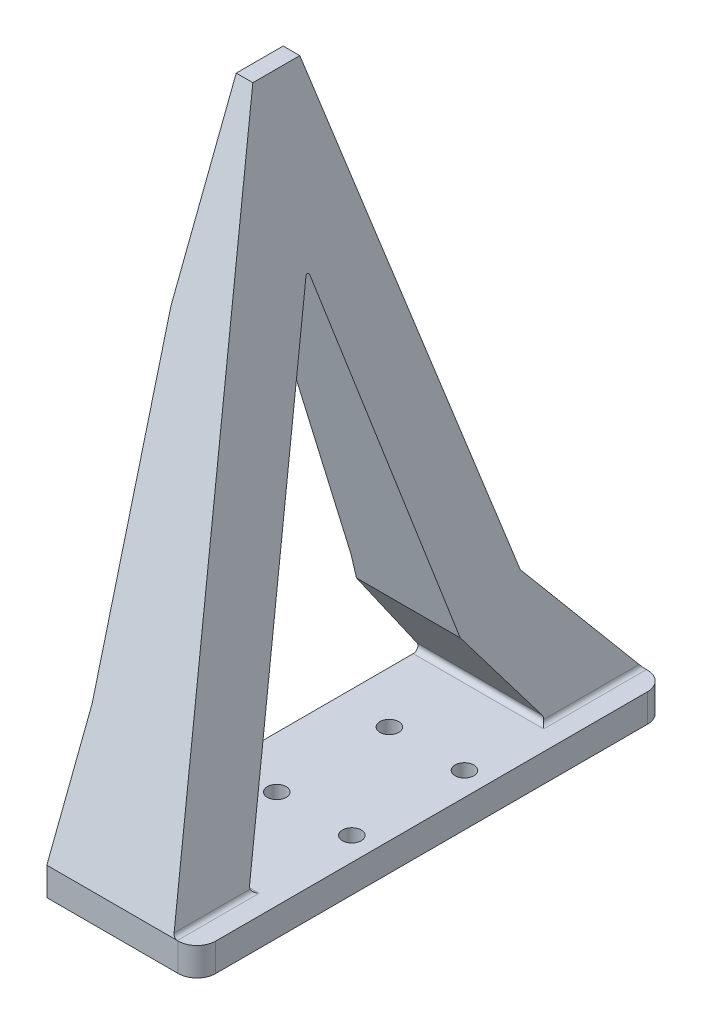
ISO-10303-21;
HEADER;
FILE_DESCRIPTION(('STEP AP214'),'2;1');
FILE_NAME('part.step','',(''),(''),'','','');
FILE_SCHEMA(('AUTOMOTIVE_DESIGN { 1 0 10303 214 1 1 1 1 }'));
ENDSEC;
DATA;
#1=APPLICATION_CONTEXT('core data for automotive mechanical design processes');
#2=APPLICATION_PROTOCOL_DEFINITION('international standard','automotive_design',2000,#1);
#3=PRODUCT_CONTEXT('',#1,'mechanical');
#4=PRODUCT('Part','Part','',(#3));
#5=PRODUCT_RELATED_PRODUCT_CATEGORY('part','',(#4));
#6=PRODUCT_DEFINITION_FORMATION('','',#4);
#7=PRODUCT_DEFINITION_CONTEXT('part definition',#1,'design');
#8=PRODUCT_DEFINITION('design','',#6,#7);
#9=PRODUCT_DEFINITION_SHAPE('','',#8);
#10=(LENGTH_UNIT() NAMED_UNIT(*) SI_UNIT(.MILLI.,.METRE.));
#11=(NAMED_UNIT(*) PLANE_ANGLE_UNIT() SI_UNIT($,.RADIAN.));
#12=(NAMED_UNIT(*) SI_UNIT($,.STERADIAN.) SOLID_ANGLE_UNIT());
#13=UNCERTAINTY_MEASURE_WITH_UNIT(LENGTH_MEASURE(1.E-05),#10,'distance_accuracy_value','');
#14=(GEOMETRIC_REPRESENTATION_CONTEXT(3) GLOBAL_UNCERTAINTY_ASSIGNED_CONTEXT((#13)) GLOBAL_UNIT_ASSIGNED_CONTEXT((#10,
#11,#12)) REPRESENTATION_CONTEXT('',''));
#15=CARTESIAN_POINT('',(0.,0.,0.));
#16=DIRECTION('',(0.,0.,1.));
#17=DIRECTION('',(1.,0.,0.));
#18=AXIS2_PLACEMENT_3D('',#15,#16,#17);
#19=CARTESIAN_POINT('',(7.25,3.,23.));
#20=DIRECTION('',(0.,1.,0.));
#21=DIRECTION('',(0.,0.,1.));
#22=AXIS2_PLACEMENT_3D('',#19,#20,#21);
#23=PLANE('',#22);
#24=DIRECTION('',(0.,0.,-1.));
#25=VECTOR('',#24,1.);
#26=CARTESIAN_POINT('',(-6.75,3.,23.));
#27=LINE('',#26,#25);
#28=CARTESIAN_POINT('',(-6.75,3.,16.2707965265877));
#29=VERTEX_POINT('',#28);
#30=CARTESIAN_POINT('',(-6.75000000000001,3.,-14.0396722192133));
#31=VERTEX_POINT('',#30);
#32=EDGE_CURVE('E432',#29,#31,#27,.T.);
#33=ORIENTED_EDGE('',*,*,#32,.F.);
#34=DIRECTION('',(1.,0.,0.));
#35=VECTOR('',#34,1.);
#36=CARTESIAN_POINT('',(7.25,3.,16.2707965265877));
#37=LINE('',#36,#35);
#38=CARTESIAN_POINT('',(7.14980374572617,3.,16.2707965265877));
#39=VERTEX_POINT('',#38);
#40=EDGE_CURVE('E284',#29,#39,#37,.T.);
#41=ORIENTED_EDGE('',*,*,#40,.T.);
#42=DIRECTION('',(0.,0.,-1.));
#43=VECTOR('',#42,1.);
#44=CARTESIAN_POINT('',(7.14980374572618,3.,23.));
#45=LINE('',#44,#43);
#46=CARTESIAN_POINT('',(7.14980374572618,3.,25.));
#47=VERTEX_POINT('',#46);
#48=EDGE_CURVE('E280',#39,#47,#45,.F.);
#49=ORIENTED_EDGE('',*,*,#48,.T.);
#50=DIRECTION('',(1.,0.,0.));
#51=VECTOR('',#50,1.);
#52=CARTESIAN_POINT('',(-9.25,3.,25.));
#53=LINE('',#52,#51);
#54=CARTESIAN_POINT('',(7.25,3.,25.));
#55=VERTEX_POINT('',#54);
#56=EDGE_CURVE('E244',#47,#55,#53,.T.);
#57=ORIENTED_EDGE('',*,*,#56,.T.);
#58=CARTESIAN_POINT('',(7.25,3.,23.));
#59=DIRECTION('',(0.,1.,0.));
#60=DIRECTION('',(0.,0.,1.));
#61=AXIS2_PLACEMENT_3D('',#58,#59,#60);
#62=CIRCLE('',#61,2.);
#63=CARTESIAN_POINT('',(9.25,3.,23.));
#64=VERTEX_POINT('',#63);
#65=EDGE_CURVE('E342',#55,#64,#62,.T.);
#66=ORIENTED_EDGE('',*,*,#65,.T.);
#67=DIRECTION('',(0.,0.,-1.));
#68=VECTOR('',#67,1.);
#69=CARTESIAN_POINT('',(9.24999999999999,3.,-23.));
#70=LINE('',#69,#68);
#71=CARTESIAN_POINT('',(9.24999999999999,3.,-23.));
#72=VERTEX_POINT('',#71);
#73=EDGE_CURVE('E340',#64,#72,#70,.T.);
#74=ORIENTED_EDGE('',*,*,#73,.T.);
#75=CARTESIAN_POINT('',(7.25,3.,-23.));
#76=DIRECTION('',(0.,1.,0.));
#77=DIRECTION('',(0.,0.,-1.));
#78=AXIS2_PLACEMENT_3D('',#75,#76,#77);
#79=CIRCLE('',#78,2.);
#80=CARTESIAN_POINT('',(7.25,3.,-25.));
#81=VERTEX_POINT('',#80);
#82=EDGE_CURVE('E338',#72,#81,#79,.T.);
#83=ORIENTED_EDGE('',*,*,#82,.T.);
#84=DIRECTION('',(-1.,0.,0.));
#85=VECTOR('',#84,1.);
#86=CARTESIAN_POINT('',(-9.25000000000001,3.,-25.));
#87=LINE('',#86,#85);
#88=CARTESIAN_POINT('',(7.14980374572616,3.,-25.));
#89=VERTEX_POINT('',#88);
#90=EDGE_CURVE('E233',#81,#89,#87,.T.);
#91=ORIENTED_EDGE('',*,*,#90,.T.);
#92=DIRECTION('',(0.,0.,-1.));
#93=VECTOR('',#92,1.);
#94=CARTESIAN_POINT('',(7.14980374572618,3.,23.));
#95=LINE('',#94,#93);
#96=CARTESIAN_POINT('',(7.14980374572617,3.,-14.0396722192133));
#97=VERTEX_POINT('',#96);
#98=EDGE_CURVE('E274',#89,#97,#95,.F.);
#99=ORIENTED_EDGE('',*,*,#98,.T.);
#100=DIRECTION('',(1.,0.,0.));
#101=VECTOR('',#100,1.);
#102=CARTESIAN_POINT('',(7.25,3.,-14.0396722192133));
#103=LINE('',#102,#101);
#104=EDGE_CURVE('E277',#97,#31,#103,.F.);
#105=ORIENTED_EDGE('',*,*,#104,.T.);
#106=EDGE_LOOP('',(#33,#41,#49,#57,#66,#74,#83,#91,#99,#105));
#107=FACE_BOUND('',#106,.T.);
#108=CARTESIAN_POINT('',(6.75,3.,-6.));
#109=DIRECTION('',(0.,1.,0.));
#110=DIRECTION('',(0.,0.,1.));
#111=AXIS2_PLACEMENT_3D('',#108,#109,#110);
#112=CIRCLE('',#111,1.);
#113=CARTESIAN_POINT('',(6.75,3.,-5.));
#114=VERTEX_POINT('',#113);
#115=EDGE_CURVE('E367',#114,#114,#112,.T.);
#116=ORIENTED_EDGE('',*,*,#115,.F.);
#117=EDGE_LOOP('',(#116));
#118=FACE_BOUND('',#117,.T.);
#119=CARTESIAN_POINT('',(6.75,3.,6.));
#120=DIRECTION('',(0.,1.,0.));
#121=DIRECTION('',(0.,0.,1.));
#122=AXIS2_PLACEMENT_3D('',#119,#120,#121);
#123=CIRCLE('',#122,1.);
#124=CARTESIAN_POINT('',(6.75,3.,7.));
#125=VERTEX_POINT('',#124);
#126=EDGE_CURVE('E358',#125,#125,#123,.T.);
#127=ORIENTED_EDGE('',*,*,#126,.F.);
#128=EDGE_LOOP('',(#127));
#129=FACE_BOUND('',#128,.T.);
#130=CARTESIAN_POINT('',(-1.25,3.,6.));
#131=DIRECTION('',(0.,1.,0.));
#132=DIRECTION('',(0.,0.,1.));
#133=AXIS2_PLACEMENT_3D('',#130,#131,#132);
#134=CIRCLE('',#133,1.);
#135=CARTESIAN_POINT('',(-1.25,3.,7.));
#136=VERTEX_POINT('',#135);
#137=EDGE_CURVE('E350',#136,#136,#134,.T.);
#138=ORIENTED_EDGE('',*,*,#137,.F.);
#139=EDGE_LOOP('',(#138));
#140=FACE_BOUND('',#139,.T.);
#141=CARTESIAN_POINT('',(-1.25,3.,-6.));
#142=DIRECTION('',(0.,1.,0.));
#143=DIRECTION('',(0.,0.,1.));
#144=AXIS2_PLACEMENT_3D('',#141,#142,#143);
#145=CIRCLE('',#144,1.);
#146=CARTESIAN_POINT('',(-1.25,3.,-5.));
#147=VERTEX_POINT('',#146);
#148=EDGE_CURVE('E354',#147,#147,#145,.T.);
#149=ORIENTED_EDGE('',*,*,#148,.F.);
#150=EDGE_LOOP('',(#149));
#151=FACE_BOUND('',#150,.T.);
#152=ADVANCED_FACE('F39',(#107,#118,#129,#140,#151),#23,.T.);
#153=CARTESIAN_POINT('',(7.25,0.,23.));
#154=DIRECTION('',(0.,1.,0.));
#155=DIRECTION('',(0.,0.,1.));
#156=AXIS2_PLACEMENT_3D('',#153,#154,#155);
#157=PLANE('',#156);
#158=DIRECTION('',(1.,0.,0.));
#159=VECTOR('',#158,1.);
#160=CARTESIAN_POINT('',(-9.25,0.,25.));
#161=LINE('',#160,#159);
#162=CARTESIAN_POINT('',(-6.75,0.,25.));
#163=VERTEX_POINT('',#162);
#164=CARTESIAN_POINT('',(7.25,0.,25.));
#165=VERTEX_POINT('',#164);
#166=EDGE_CURVE('E210',#163,#165,#161,.T.);
#167=ORIENTED_EDGE('',*,*,#166,.F.);
#168=DIRECTION('',(0.,0.,-1.));
#169=VECTOR('',#168,1.);
#170=CARTESIAN_POINT('',(-6.75,0.,25.));
#171=LINE('',#170,#169);
#172=CARTESIAN_POINT('',(-6.75000000000001,0.,-25.));
#173=VERTEX_POINT('',#172);
#174=EDGE_CURVE('E190',#163,#173,#171,.T.);
#175=ORIENTED_EDGE('',*,*,#174,.T.);
#176=DIRECTION('',(-1.,0.,0.));
#177=VECTOR('',#176,1.);
#178=CARTESIAN_POINT('',(-9.25000000000001,0.,-25.));
#179=LINE('',#178,#177);
#180=CARTESIAN_POINT('',(7.25,0.,-25.));
#181=VERTEX_POINT('',#180);
#182=EDGE_CURVE('E241',#181,#173,#179,.T.);
#183=ORIENTED_EDGE('',*,*,#182,.F.);
#184=CARTESIAN_POINT('',(7.25,0.,-23.));
#185=DIRECTION('',(0.,1.,0.));
#186=DIRECTION('',(0.,0.,-1.));
#187=AXIS2_PLACEMENT_3D('',#184,#185,#186);
#188=CIRCLE('',#187,2.);
#189=CARTESIAN_POINT('',(9.24999999999999,0.,-23.));
#190=VERTEX_POINT('',#189);
#191=EDGE_CURVE('E238',#190,#181,#188,.T.);
#192=ORIENTED_EDGE('',*,*,#191,.F.);
#193=DIRECTION('',(0.,0.,-1.));
#194=VECTOR('',#193,1.);
#195=CARTESIAN_POINT('',(9.24999999999999,0.,-23.));
#196=LINE('',#195,#194);
#197=CARTESIAN_POINT('',(9.25,0.,23.));
#198=VERTEX_POINT('',#197);
#199=EDGE_CURVE('E227',#198,#190,#196,.T.);
#200=ORIENTED_EDGE('',*,*,#199,.F.);
#201=CARTESIAN_POINT('',(7.25,0.,23.));
#202=DIRECTION('',(0.,1.,0.));
#203=DIRECTION('',(0.,0.,1.));
#204=AXIS2_PLACEMENT_3D('',#201,#202,#203);
#205=CIRCLE('',#204,2.);
#206=EDGE_CURVE('E220',#165,#198,#205,.T.);
#207=ORIENTED_EDGE('',*,*,#206,.F.);
#208=EDGE_LOOP('',(#167,#175,#183,#192,#200,#207));
#209=FACE_BOUND('',#208,.T.);
#210=CARTESIAN_POINT('',(-1.25,0.,6.));
#211=DIRECTION('',(0.,1.,0.));
#212=DIRECTION('',(0.,0.,1.));
#213=AXIS2_PLACEMENT_3D('',#210,#211,#212);
#214=CIRCLE('',#213,1.);
#215=CARTESIAN_POINT('',(-1.25,0.,7.));
#216=VERTEX_POINT('',#215);
#217=EDGE_CURVE('E223',#216,#216,#214,.T.);
#218=ORIENTED_EDGE('',*,*,#217,.T.);
#219=EDGE_LOOP('',(#218));
#220=FACE_BOUND('',#219,.T.);
#221=CARTESIAN_POINT('',(-1.25,0.,-6.));
#222=DIRECTION('',(0.,1.,0.));
#223=DIRECTION('',(0.,0.,1.));
#224=AXIS2_PLACEMENT_3D('',#221,#222,#223);
#225=CIRCLE('',#224,1.);
#226=CARTESIAN_POINT('',(-1.25,0.,-5.));
#227=VERTEX_POINT('',#226);
#228=EDGE_CURVE('E230',#227,#227,#225,.T.);
#229=ORIENTED_EDGE('',*,*,#228,.T.);
#230=EDGE_LOOP('',(#229));
#231=FACE_BOUND('',#230,.T.);
#232=CARTESIAN_POINT('',(6.75,0.,6.));
#233=DIRECTION('',(0.,1.,0.));
#234=DIRECTION('',(0.,0.,1.));
#235=AXIS2_PLACEMENT_3D('',#232,#233,#234);
#236=CIRCLE('',#235,1.);
#237=CARTESIAN_POINT('',(6.75,0.,7.));
#238=VERTEX_POINT('',#237);
#239=EDGE_CURVE('E363',#238,#238,#236,.T.);
#240=ORIENTED_EDGE('',*,*,#239,.T.);
#241=EDGE_LOOP('',(#240));
#242=FACE_BOUND('',#241,.T.);
#243=CARTESIAN_POINT('',(6.75,0.,-6.));
#244=DIRECTION('',(0.,1.,0.));
#245=DIRECTION('',(0.,0.,1.));
#246=AXIS2_PLACEMENT_3D('',#243,#244,#245);
#247=CIRCLE('',#246,1.);
#248=CARTESIAN_POINT('',(6.75,0.,-5.));
#249=VERTEX_POINT('',#248);
#250=EDGE_CURVE('E362',#249,#249,#247,.T.);
#251=ORIENTED_EDGE('',*,*,#250,.T.);
#252=EDGE_LOOP('',(#251));
#253=FACE_BOUND('',#252,.T.);
#254=ADVANCED_FACE('F217',(#209,#220,#231,#242,#253),#157,.F.);
#255=CARTESIAN_POINT('',(-9.25,3.,25.));
#256=DIRECTION('',(0.,0.,-1.));
#257=DIRECTION('',(-1.,0.,0.));
#258=AXIS2_PLACEMENT_3D('',#255,#256,#257);
#259=PLANE('',#258);
#260=DIRECTION('',(1.,0.,0.));
#261=VECTOR('',#260,1.);
#262=CARTESIAN_POINT('',(-9.25000000000001,3.,25.));
#263=LINE('',#262,#261);
#264=CARTESIAN_POINT('',(-6.75,3.,25.));
#265=VERTEX_POINT('',#264);
#266=EDGE_CURVE('E213',#265,#47,#263,.T.);
#267=ORIENTED_EDGE('',*,*,#266,.F.);
#268=DIRECTION('',(0.,-1.,0.));
#269=VECTOR('',#268,1.);
#270=CARTESIAN_POINT('',(-6.75,15.5,25.));
#271=LINE('',#270,#269);
#272=EDGE_CURVE('E194',#265,#163,#271,.T.);
#273=ORIENTED_EDGE('',*,*,#272,.T.);
#274=ORIENTED_EDGE('',*,*,#166,.T.);
#275=DIRECTION('',(0.,-1.,0.));
#276=VECTOR('',#275,1.);
#277=CARTESIAN_POINT('',(7.25,3.,25.));
#278=LINE('',#277,#276);
#279=EDGE_CURVE('E257',#55,#165,#278,.T.);
#280=ORIENTED_EDGE('',*,*,#279,.F.);
#281=ORIENTED_EDGE('',*,*,#56,.F.);
#282=EDGE_LOOP('',(#267,#273,#274,#280,#281));
#283=FACE_BOUND('',#282,.T.);
#284=ADVANCED_FACE('F208',(#283),#259,.F.);
#285=CARTESIAN_POINT('',(7.25,3.,23.));
#286=DIRECTION('',(0.,-1.,0.));
#287=DIRECTION('',(0.,0.,-1.));
#288=AXIS2_PLACEMENT_3D('',#285,#286,#287);
#289=CYLINDRICAL_SURFACE('',#288,2.);
#290=ORIENTED_EDGE('',*,*,#206,.T.);
#291=DIRECTION('',(0.,-1.,0.));
#292=VECTOR('',#291,1.);
#293=CARTESIAN_POINT('',(9.25,3.,23.));
#294=LINE('',#293,#292);
#295=EDGE_CURVE('E253',#64,#198,#294,.T.);
#296=ORIENTED_EDGE('',*,*,#295,.F.);
#297=ORIENTED_EDGE('',*,*,#65,.F.);
#298=ORIENTED_EDGE('',*,*,#279,.T.);
#299=EDGE_LOOP('',(#290,#296,#297,#298));
#300=FACE_BOUND('',#299,.T.);
#301=ADVANCED_FACE('F569',(#300),#289,.T.);
#302=CARTESIAN_POINT('',(9.24999999999999,3.,-23.));
#303=DIRECTION('',(-1.,0.,0.));
#304=DIRECTION('',(0.,0.,1.));
#305=AXIS2_PLACEMENT_3D('',#302,#303,#304);
#306=PLANE('',#305);
#307=ORIENTED_EDGE('',*,*,#199,.T.);
#308=DIRECTION('',(0.,-1.,0.));
#309=VECTOR('',#308,1.);
#310=CARTESIAN_POINT('',(9.24999999999999,3.,-23.));
#311=LINE('',#310,#309);
#312=EDGE_CURVE('E249',#72,#190,#311,.T.);
#313=ORIENTED_EDGE('',*,*,#312,.F.);
#314=ORIENTED_EDGE('',*,*,#73,.F.);
#315=ORIENTED_EDGE('',*,*,#295,.T.);
#316=EDGE_LOOP('',(#307,#313,#314,#315));
#317=FACE_BOUND('',#316,.T.);
#318=ADVANCED_FACE('F565',(#317),#306,.F.);
#319=CARTESIAN_POINT('',(7.25,3.,-23.));
#320=DIRECTION('',(0.,-1.,0.));
#321=DIRECTION('',(0.,0.,-1.));
#322=AXIS2_PLACEMENT_3D('',#319,#320,#321);
#323=CYLINDRICAL_SURFACE('',#322,2.);
#324=ORIENTED_EDGE('',*,*,#191,.T.);
#325=DIRECTION('',(0.,-1.,0.));
#326=VECTOR('',#325,1.);
#327=CARTESIAN_POINT('',(7.25,3.,-25.));
#328=LINE('',#327,#326);
#329=EDGE_CURVE('E245',#81,#181,#328,.T.);
#330=ORIENTED_EDGE('',*,*,#329,.F.);
#331=ORIENTED_EDGE('',*,*,#82,.F.);
#332=ORIENTED_EDGE('',*,*,#312,.T.);
#333=EDGE_LOOP('',(#324,#330,#331,#332));
#334=FACE_BOUND('',#333,.T.);
#335=ADVANCED_FACE('F561',(#334),#323,.T.);
#336=CARTESIAN_POINT('',(-9.25000000000001,3.,-25.));
#337=DIRECTION('',(0.,0.,1.));
#338=DIRECTION('',(1.,0.,0.));
#339=AXIS2_PLACEMENT_3D('',#336,#337,#338);
#340=PLANE('',#339);
#341=ORIENTED_EDGE('',*,*,#182,.T.);
#342=DIRECTION('',(0.,-1.,0.));
#343=VECTOR('',#342,1.);
#344=CARTESIAN_POINT('',(-6.75000000000001,15.5,-25.));
#345=LINE('',#344,#343);
#346=CARTESIAN_POINT('',(-6.75000000000001,3.,-25.));
#347=VERTEX_POINT('',#346);
#348=EDGE_CURVE('E197',#347,#173,#345,.T.);
#349=ORIENTED_EDGE('',*,*,#348,.F.);
#350=DIRECTION('',(1.,0.,0.));
#351=VECTOR('',#350,1.);
#352=CARTESIAN_POINT('',(-9.25000000000001,3.,-25.));
#353=LINE('',#352,#351);
#354=EDGE_CURVE('E388',#347,#89,#353,.T.);
#355=ORIENTED_EDGE('',*,*,#354,.T.);
#356=ORIENTED_EDGE('',*,*,#90,.F.);
#357=ORIENTED_EDGE('',*,*,#329,.T.);
#358=EDGE_LOOP('',(#341,#349,#355,#356,#357));
#359=FACE_BOUND('',#358,.T.);
#360=ADVANCED_FACE('F558',(#359),#340,.F.);
#361=CARTESIAN_POINT('',(-1.25,3.,6.));
#362=DIRECTION('',(0.,-1.,0.));
#363=DIRECTION('',(0.,0.,-1.));
#364=AXIS2_PLACEMENT_3D('',#361,#362,#363);
#365=CYLINDRICAL_SURFACE('',#364,1.);
#366=ORIENTED_EDGE('',*,*,#137,.T.);
#367=EDGE_LOOP('',(#366));
#368=FACE_BOUND('',#367,.T.);
#369=ORIENTED_EDGE('',*,*,#217,.F.);
#370=EDGE_LOOP('',(#369));
#371=FACE_BOUND('',#370,.T.);
#372=ADVANCED_FACE('F555',(#368,#371),#365,.F.);
#373=CARTESIAN_POINT('',(-1.25,3.,-6.));
#374=DIRECTION('',(0.,-1.,0.));
#375=DIRECTION('',(0.,0.,-1.));
#376=AXIS2_PLACEMENT_3D('',#373,#374,#375);
#377=CYLINDRICAL_SURFACE('',#376,1.);
#378=ORIENTED_EDGE('',*,*,#148,.T.);
#379=EDGE_LOOP('',(#378));
#380=FACE_BOUND('',#379,.T.);
#381=ORIENTED_EDGE('',*,*,#228,.F.);
#382=EDGE_LOOP('',(#381));
#383=FACE_BOUND('',#382,.T.);
#384=ADVANCED_FACE('F602',(#380,#383),#377,.F.);
#385=CARTESIAN_POINT('',(6.75,3.,6.));
#386=DIRECTION('',(0.,-1.,0.));
#387=DIRECTION('',(0.,0.,-1.));
#388=AXIS2_PLACEMENT_3D('',#385,#386,#387);
#389=CYLINDRICAL_SURFACE('',#388,1.);
#390=ORIENTED_EDGE('',*,*,#126,.T.);
#391=EDGE_LOOP('',(#390));
#392=FACE_BOUND('',#391,.T.);
#393=ORIENTED_EDGE('',*,*,#239,.F.);
#394=EDGE_LOOP('',(#393));
#395=FACE_BOUND('',#394,.T.);
#396=ADVANCED_FACE('F609',(#392,#395),#389,.F.);
#397=CARTESIAN_POINT('',(6.75,3.,-6.));
#398=DIRECTION('',(0.,-1.,0.));
#399=DIRECTION('',(0.,0.,-1.));
#400=AXIS2_PLACEMENT_3D('',#397,#398,#399);
#401=CYLINDRICAL_SURFACE('',#400,1.);
#402=ORIENTED_EDGE('',*,*,#115,.T.);
#403=EDGE_LOOP('',(#402));
#404=FACE_BOUND('',#403,.T.);
#405=ORIENTED_EDGE('',*,*,#250,.F.);
#406=EDGE_LOOP('',(#405));
#407=FACE_BOUND('',#406,.T.);
#408=ADVANCED_FACE('F616',(#404,#407),#401,.F.);
#409=CARTESIAN_POINT('',(-9.25000000000001,3.,25.));
#410=DIRECTION('',(0.,-0.360399279202163,-0.932798134405597));
#411=DIRECTION('',(0.,0.932798134405597,-0.360399279202163));
#412=AXIS2_PLACEMENT_3D('',#409,#410,#411);
#413=PLANE('',#412);
#414=DIRECTION('',(0.0944368800750727,-0.928629320738214,0.35878860119431));
#415=VECTOR('',#414,1.);
#416=CARTESIAN_POINT('',(-5.51244622306482,3.3307211934708,24.8722213570681));
#417=LINE('',#416,#415);
#418=CARTESIAN_POINT('',(-9.75,45.,8.77272727272728));
#419=VERTEX_POINT('',#418);
#420=CARTESIAN_POINT('',(-6.75,15.5,20.1704545454546));
#421=VERTEX_POINT('',#420);
#422=EDGE_CURVE('E436',#419,#421,#417,.T.);
#423=ORIENTED_EDGE('',*,*,#422,.T.);
#424=DIRECTION('',(0.,-0.932798134405597,0.360399279202163));
#425=VECTOR('',#424,1.);
#426=CARTESIAN_POINT('',(-6.75,3.,25.));
#427=LINE('',#426,#425);
#428=EDGE_CURVE('E417',#421,#265,#427,.T.);
#429=ORIENTED_EDGE('',*,*,#428,.T.);
#430=ORIENTED_EDGE('',*,*,#266,.T.);
#431=CARTESIAN_POINT('',(7.14980374572618,3.5,24.8068181818182));
#432=DIRECTION('',(0.,-0.360399279202163,-0.932798134405597));
#433=DIRECTION('',(0.,0.932798134405597,-0.360399279202163));
#434=AXIS2_PLACEMENT_3D('',#431,#432,#433);
#435=ELLIPSE('',#434,0.536021655230489,0.5);
#436=CARTESIAN_POINT('',(6.66423660577136,3.38073327121071,24.8528985088504));
#437=VERTEX_POINT('',#436);
#438=EDGE_CURVE('E315',#47,#437,#435,.T.);
#439=ORIENTED_EDGE('',*,*,#438,.T.);
#440=DIRECTION('',(-0.223330342013913,0.909238280764876,-0.351296608477339));
#441=VECTOR('',#440,1.);
#442=CARTESIAN_POINT('',(5.95934387474381,6.25054240284771,23.7441086170816));
#443=LINE('',#442,#441);
#444=CARTESIAN_POINT('',(-7.97965984121769,63.,1.81818181818182));
#445=VERTEX_POINT('',#444);
#446=EDGE_CURVE('E396',#437,#445,#443,.T.);
#447=ORIENTED_EDGE('',*,*,#446,.T.);
#448=DIRECTION('',(1.,0.,0.));
#449=VECTOR('',#448,1.);
#450=CARTESIAN_POINT('',(-9.25000000000001,63.,1.81818181818182));
#451=LINE('',#450,#449);
#452=CARTESIAN_POINT('',(-9.75,63.,1.81818181818182));
#453=VERTEX_POINT('',#452);
#454=EDGE_CURVE('E377',#453,#445,#451,.T.);
#455=ORIENTED_EDGE('',*,*,#454,.F.);
#456=DIRECTION('',(0.,-0.932798134405597,0.360399279202163));
#457=VECTOR('',#456,1.);
#458=CARTESIAN_POINT('',(-9.75,3.,25.));
#459=LINE('',#458,#457);
#460=EDGE_CURVE('E448',#453,#419,#459,.T.);
#461=ORIENTED_EDGE('',*,*,#460,.T.);
#462=EDGE_LOOP('',(#423,#429,#430,#439,#447,#455,#461));
#463=FACE_BOUND('',#462,.T.);
#464=ADVANCED_FACE('F482',(#463),#413,.F.);
#465=CARTESIAN_POINT('',(-9.25000000000001,3.,-25.));
#466=DIRECTION('',(0.,-0.624695047554424,0.78086880944303));
#467=DIRECTION('',(0.,-0.78086880944303,-0.624695047554424));
#468=AXIS2_PLACEMENT_3D('',#465,#466,#467);
#469=PLANE('',#468);
#470=ORIENTED_EDGE('',*,*,#354,.F.);
#471=DIRECTION('',(0.,0.78086880944303,0.624695047554424));
#472=VECTOR('',#471,1.);
#473=CARTESIAN_POINT('',(-6.75000000000001,3.,-25.));
#474=LINE('',#473,#472);
#475=CARTESIAN_POINT('',(-6.75,15.5,-15.));
#476=VERTEX_POINT('',#475);
#477=EDGE_CURVE('E420',#347,#476,#474,.T.);
#478=ORIENTED_EDGE('',*,*,#477,.T.);
#479=DIRECTION('',(1.,0.,0.));
#480=VECTOR('',#479,1.);
#481=CARTESIAN_POINT('',(-9.25000000000001,15.5,-15.));
#482=LINE('',#481,#480);
#483=CARTESIAN_POINT('',(3.68745918586171,15.5,-15.));
#484=VERTEX_POINT('',#483);
#485=EDGE_CURVE('E385',#476,#484,#482,.T.);
#486=ORIENTED_EDGE('',*,*,#485,.T.);
#487=DIRECTION('',(0.188366336395067,-0.766890348679805,-0.613512278943843));
#488=VECTOR('',#487,1.);
#489=CARTESIAN_POINT('',(6.18976852503695,5.31242127255662,-23.1500629819547));
#490=LINE('',#489,#488);
#491=CARTESIAN_POINT('',(6.66423660577135,3.38073327121071,-24.6954133830314));
#492=VERTEX_POINT('',#491);
#493=EDGE_CURVE('E399',#484,#492,#490,.T.);
#494=ORIENTED_EDGE('',*,*,#493,.T.);
#495=CARTESIAN_POINT('',(7.14980374572617,3.5,-24.6));
#496=DIRECTION('',(0.,-0.624695047554424,0.78086880944303));
#497=DIRECTION('',(0.,-0.780868809443031,-0.624695047554424));
#498=AXIS2_PLACEMENT_3D('',#495,#496,#497);
#499=ELLIPSE('',#498,0.640312423743285,0.5);
#500=EDGE_CURVE('E318',#492,#89,#499,.T.);
#501=ORIENTED_EDGE('',*,*,#500,.T.);
#502=EDGE_LOOP('',(#470,#478,#486,#494,#501));
#503=FACE_BOUND('',#502,.T.);
#504=ADVANCED_FACE('F500',(#503),#469,.F.);
#505=CARTESIAN_POINT('',(-9.25000000000001,15.5,-15.));
#506=DIRECTION('',(0.,-0.241442969126738,0.970415010528622));
#507=DIRECTION('',(0.,-0.970415010528622,-0.241442969126738));
#508=AXIS2_PLACEMENT_3D('',#505,#506,#507);
#509=PLANE('',#508);
#510=ORIENTED_EDGE('',*,*,#485,.F.);
#511=DIRECTION('',(-0.0982092022421167,0.965723822047482,0.240275783475928));
#512=VECTOR('',#511,1.);
#513=CARTESIAN_POINT('',(-6.77411261851259,15.7371074153737,-14.9410067674668));
#514=LINE('',#513,#512);
#515=CARTESIAN_POINT('',(-9.75,45.,-7.6602870813397));
#516=VERTEX_POINT('',#515);
#517=EDGE_CURVE('E440',#476,#516,#514,.T.);
#518=ORIENTED_EDGE('',*,*,#517,.T.);
#519=DIRECTION('',(0.,0.970415010528622,0.241442969126738));
#520=VECTOR('',#519,1.);
#521=CARTESIAN_POINT('',(-9.75000000000001,15.5,-15.));
#522=LINE('',#521,#520);
#523=CARTESIAN_POINT('',(-9.75,63.,-3.18181818181818));
#524=VERTEX_POINT('',#523);
#525=EDGE_CURVE('E452',#516,#524,#522,.T.);
#526=ORIENTED_EDGE('',*,*,#525,.T.);
#527=DIRECTION('',(1.,0.,0.));
#528=VECTOR('',#527,1.);
#529=CARTESIAN_POINT('',(-9.25000000000001,63.,-3.18181818181818));
#530=LINE('',#529,#528);
#531=CARTESIAN_POINT('',(-7.9796598412177,63.,-3.18181818181818));
#532=VERTEX_POINT('',#531);
#533=EDGE_CURVE('E381',#524,#532,#530,.T.);
#534=ORIENTED_EDGE('',*,*,#533,.T.);
#535=DIRECTION('',(0.231861293381906,-0.943970093223388,-0.234863372476632));
#536=VECTOR('',#535,1.);
#537=CARTESIAN_POINT('',(2.99194578693293,18.3316233315558,-14.2954812763593));
#538=LINE('',#537,#536);
#539=EDGE_CURVE('E403',#532,#484,#538,.T.);
#540=ORIENTED_EDGE('',*,*,#539,.T.);
#541=EDGE_LOOP('',(#510,#518,#526,#534,#540));
#542=FACE_BOUND('',#541,.T.);
#543=ADVANCED_FACE('F493',(#542),#509,.F.);
#544=CARTESIAN_POINT('',(-9.25000000000001,63.,-3.18181818181818));
#545=DIRECTION('',(0.,-1.,0.));
#546=DIRECTION('',(0.,0.,-1.));
#547=AXIS2_PLACEMENT_3D('',#544,#545,#546);
#548=PLANE('',#547);
#549=ORIENTED_EDGE('',*,*,#533,.F.);
#550=DIRECTION('',(0.,0.,1.));
#551=VECTOR('',#550,1.);
#552=CARTESIAN_POINT('',(-9.75,63.,-3.18181818181818));
#553=LINE('',#552,#551);
#554=EDGE_CURVE('E456',#524,#453,#553,.T.);
#555=ORIENTED_EDGE('',*,*,#554,.T.);
#556=ORIENTED_EDGE('',*,*,#454,.T.);
#557=DIRECTION('',(0.,0.,-1.));
#558=VECTOR('',#557,1.);
#559=CARTESIAN_POINT('',(-7.9796598412177,63.,-3.18181818181818));
#560=LINE('',#559,#558);
#561=EDGE_CURVE('E407',#445,#532,#560,.T.);
#562=ORIENTED_EDGE('',*,*,#561,.T.);
#563=EDGE_LOOP('',(#549,#555,#556,#562));
#564=FACE_BOUND('',#563,.T.);
#565=ADVANCED_FACE('F488',(#564),#548,.F.);
#566=CARTESIAN_POINT('',(-9.25000000000001,13.,-8.));
#567=DIRECTION('',(0.,0.229039333725547,-0.973417168333576));
#568=DIRECTION('',(0.,0.973417168333576,0.229039333725547));
#569=AXIS2_PLACEMENT_3D('',#566,#567,#568);
#570=PLANE('',#569);
#571=DIRECTION('',(-0.232539867489788,0.946732752115406,0.222760647556566));
#572=VECTOR('',#571,1.);
#573=CARTESIAN_POINT('',(3.56872258793431,15.9834088337027,-7.29802145089347));
#574=LINE('',#573,#572);
#575=CARTESIAN_POINT('',(4.30151808202378,13.,-8.));
#576=VERTEX_POINT('',#575);
#577=CARTESIAN_POINT('',(-3.89503915105911,46.3704034104552,-0.148140374010538));
#578=VERTEX_POINT('',#577);
#579=EDGE_CURVE('E414',#576,#578,#574,.T.);
#580=ORIENTED_EDGE('',*,*,#579,.T.);
#581=DIRECTION('',(1.,0.,0.));
#582=VECTOR('',#581,1.);
#583=CARTESIAN_POINT('',(-9.75,46.3704034104552,-0.14814037401054));
#584=LINE('',#583,#582);
#585=CARTESIAN_POINT('',(-9.75,46.3704034104552,-0.148140374010541));
#586=VERTEX_POINT('',#585);
#587=EDGE_CURVE('E55',#578,#586,#584,.F.);
#588=ORIENTED_EDGE('',*,*,#587,.T.);
#589=DIRECTION('',(0.,-0.973417168333576,-0.229039333725547));
#590=VECTOR('',#589,1.);
#591=CARTESIAN_POINT('',(-9.75000000000001,13.,-8.));
#592=LINE('',#591,#590);
#593=CARTESIAN_POINT('',(-9.75,45.,-0.470588235294116));
#594=VERTEX_POINT('',#593);
#595=EDGE_CURVE('E203',#586,#594,#592,.T.);
#596=ORIENTED_EDGE('',*,*,#595,.T.);
#597=DIRECTION('',(0.0985100866026048,-0.968682518258947,-0.22792529841387));
#598=VECTOR('',#597,1.);
#599=CARTESIAN_POINT('',(-6.52249048371015,13.2628230898164,-7.93815927298437));
#600=LINE('',#599,#598);
#601=CARTESIAN_POINT('',(-6.75,15.5,-7.41176470588235));
#602=VERTEX_POINT('',#601);
#603=EDGE_CURVE('E444',#594,#602,#600,.T.);
#604=ORIENTED_EDGE('',*,*,#603,.T.);
#605=DIRECTION('',(0.,-0.973417168333576,-0.229039333725547));
#606=VECTOR('',#605,1.);
#607=CARTESIAN_POINT('',(-6.75,13.,-8.));
#608=LINE('',#607,#606);
#609=CARTESIAN_POINT('',(-6.75,13.,-8.));
#610=VERTEX_POINT('',#609);
#611=EDGE_CURVE('E424',#602,#610,#608,.T.);
#612=ORIENTED_EDGE('',*,*,#611,.T.);
#613=DIRECTION('',(1.,0.,0.));
#614=VECTOR('',#613,1.);
#615=CARTESIAN_POINT('',(-9.25000000000001,13.,-8.));
#616=LINE('',#615,#614);
#617=EDGE_CURVE('E382',#610,#576,#616,.T.);
#618=ORIENTED_EDGE('',*,*,#617,.T.);
#619=EDGE_LOOP('',(#580,#588,#596,#604,#612,#618));
#620=FACE_BOUND('',#619,.T.);
#621=ADVANCED_FACE('F517',(#620),#570,.F.);
#622=CARTESIAN_POINT('',(-9.25000000000001,3.,-15.));
#623=DIRECTION('',(0.,0.573462344363328,-0.819231920519041));
#624=DIRECTION('',(0.,0.819231920519041,0.573462344363328));
#625=AXIS2_PLACEMENT_3D('',#622,#623,#624);
#626=PLANE('',#625);
#627=DIRECTION('',(0.,-0.819231920519041,-0.573462344363328));
#628=VECTOR('',#627,1.);
#629=CARTESIAN_POINT('',(-6.75000000000001,3.,-15.));
#630=LINE('',#629,#628);
#631=CARTESIAN_POINT('',(-6.75000000000001,3.78673117218166,-14.4492881794728));
#632=VERTEX_POINT('',#631);
#633=EDGE_CURVE('E428',#610,#632,#630,.T.);
#634=ORIENTED_EDGE('',*,*,#633,.T.);
#635=DIRECTION('',(1.,0.,0.));
#636=VECTOR('',#635,1.);
#637=CARTESIAN_POINT('',(-9.25000000000001,3.78673117218166,-14.4492881794728));
#638=LINE('',#637,#636);
#639=CARTESIAN_POINT('',(6.56451395660561,3.78673117218166,-14.4492881794728));
#640=VERTEX_POINT('',#639);
#641=EDGE_CURVE('E291',#632,#640,#638,.T.);
#642=ORIENTED_EDGE('',*,*,#641,.T.);
#643=DIRECTION('',(-0.197268532025354,0.803133597030763,0.562193517921533));
#644=VECTOR('',#643,1.);
#645=CARTESIAN_POINT('',(6.1348139540736,5.53615620786505,-13.2246906544945));
#646=LINE('',#645,#644);
#647=EDGE_CURVE('E411',#640,#576,#646,.T.);
#648=ORIENTED_EDGE('',*,*,#647,.T.);
#649=ORIENTED_EDGE('',*,*,#617,.F.);
#650=EDGE_LOOP('',(#634,#642,#648,#649));
#651=FACE_BOUND('',#650,.T.);
#652=ADVANCED_FACE('F515',(#651),#626,.F.);
#653=CARTESIAN_POINT('',(-9.25000000000001,47.,0.));
#654=DIRECTION('',(0.,0.360399279202163,0.932798134405597));
#655=DIRECTION('',(0.,-0.932798134405597,0.360399279202163));
#656=AXIS2_PLACEMENT_3D('',#653,#654,#655);
#657=PLANE('',#656);
#658=DIRECTION('',(0.,0.932798134405597,-0.360399279202163));
#659=VECTOR('',#658,1.);
#660=CARTESIAN_POINT('',(-9.75,47.,0.));
#661=LINE('',#660,#659);
#662=CARTESIAN_POINT('',(-9.75,45.,0.772727272727281));
#663=VERTEX_POINT('',#662);
#664=CARTESIAN_POINT('',(-9.75,46.3966753995505,0.233102686537296));
#665=VERTEX_POINT('',#664);
#666=EDGE_CURVE('E263',#663,#665,#661,.T.);
#667=ORIENTED_EDGE('',*,*,#666,.T.);
#668=DIRECTION('',(1.,0.,0.));
#669=VECTOR('',#668,1.);
#670=CARTESIAN_POINT('',(-4.04968290578042,46.3966753995505,0.233102686537296));
#671=LINE('',#670,#669);
#672=CARTESIAN_POINT('',(-3.90149217050865,46.3966753995505,0.233102686537296));
#673=VERTEX_POINT('',#672);
#674=EDGE_CURVE('E322',#665,#673,#671,.T.);
#675=ORIENTED_EDGE('',*,*,#674,.T.);
#676=DIRECTION('',(0.223330342013913,-0.909238280764876,0.351296608477339));
#677=VECTOR('',#676,1.);
#678=CARTESIAN_POINT('',(-4.30905621796483,48.0559789696295,-0.407991874629564));
#679=LINE('',#678,#677);
#680=CARTESIAN_POINT('',(6.59068061072678,3.68019963960108,16.7371955937905));
#681=VERTEX_POINT('',#680);
#682=EDGE_CURVE('E260',#673,#681,#679,.T.);
#683=ORIENTED_EDGE('',*,*,#682,.T.);
#684=DIRECTION('',(1.,0.,0.));
#685=VECTOR('',#684,1.);
#686=CARTESIAN_POINT('',(-9.25000000000001,3.68019963960108,16.7371955937905));
#687=LINE('',#686,#685);
#688=CARTESIAN_POINT('',(-6.75,3.68019963960107,16.7371955937905));
#689=VERTEX_POINT('',#688);
#690=EDGE_CURVE('E288',#681,#689,#687,.F.);
#691=ORIENTED_EDGE('',*,*,#690,.T.);
#692=DIRECTION('',(0.,0.932798134405597,-0.360399279202163));
#693=VECTOR('',#692,1.);
#694=CARTESIAN_POINT('',(-6.75,47.,0.));
#695=LINE('',#694,#693);
#696=CARTESIAN_POINT('',(-6.75,15.5,12.1704545454546));
#697=VERTEX_POINT('',#696);
#698=EDGE_CURVE('E271',#689,#697,#695,.T.);
#699=ORIENTED_EDGE('',*,*,#698,.T.);
#700=DIRECTION('',(-0.0944368800750727,0.928629320738214,-0.35878860119431));
#701=VECTOR('',#700,1.);
#702=CARTESIAN_POINT('',(-9.9471167718778,46.938314923465,0.0238328704794328));
#703=LINE('',#702,#701);
#704=EDGE_CURVE('E267',#697,#663,#703,.T.);
#705=ORIENTED_EDGE('',*,*,#704,.T.);
#706=EDGE_LOOP('',(#667,#675,#683,#691,#699,#705));
#707=FACE_BOUND('',#706,.T.);
#708=ADVANCED_FACE('F527',(#707),#657,.F.);
#709=CARTESIAN_POINT('',(6.75775366667209,3.,25.));
#710=DIRECTION('',(-0.971134279909635,-0.238533457578585,0.));
#711=DIRECTION('',(0.238533457578585,-0.971134279909635,0.));
#712=AXIS2_PLACEMENT_3D('',#709,#710,#711);
#713=PLANE('',#712);
#714=ORIENTED_EDGE('',*,*,#446,.F.);
#715=DIRECTION('',(0.,0.,-1.));
#716=VECTOR('',#715,1.);
#717=CARTESIAN_POINT('',(6.66423660577136,3.38073327121071,25.));
#718=LINE('',#717,#716);
#719=CARTESIAN_POINT('',(6.66423660577136,3.38073327121071,16.7563636665425));
#720=VERTEX_POINT('',#719);
#721=EDGE_CURVE('E298',#437,#720,#718,.T.);
#722=ORIENTED_EDGE('',*,*,#721,.T.);
#723=CARTESIAN_POINT('',(6.63494188743967,3.5,16.2707965265877));
#724=DIRECTION('',(-0.971134279909635,-0.238533457578585,0.));
#725=DIRECTION('',(0.238533457578585,-0.971134279909635,0.));
#726=AXIS2_PLACEMENT_3D('',#723,#724,#725);
#727=ELLIPSE('',#726,0.514861858286503,0.5);
#728=EDGE_CURVE('E301',#720,#681,#727,.T.);
#729=ORIENTED_EDGE('',*,*,#728,.T.);
#730=ORIENTED_EDGE('',*,*,#682,.F.);
#731=CARTESIAN_POINT('',(-3.88378765982349,46.3245955437101,0.0465430596561753));
#732=DIRECTION('',(-0.971134279909635,-0.238533457578585,0.));
#733=DIRECTION('',(-0.238533457578585,0.971134279909635,0.));
#734=AXIS2_PLACEMENT_3D('',#731,#732,#733);
#735=ELLIPSE('',#734,0.205944743314601,0.2);
#736=EDGE_CURVE('E48',#673,#578,#735,.T.);
#737=ORIENTED_EDGE('',*,*,#736,.T.);
#738=ORIENTED_EDGE('',*,*,#579,.F.);
#739=ORIENTED_EDGE('',*,*,#647,.F.);
#740=CARTESIAN_POINT('',(6.63494188743967,3.5,-14.0396722192133));
#741=DIRECTION('',(-0.971134279909635,-0.238533457578585,0.));
#742=DIRECTION('',(0.238533457578585,-0.971134279909635,0.));
#743=AXIS2_PLACEMENT_3D('',#740,#741,#742);
#744=ELLIPSE('',#743,0.514861858286503,0.5);
#745=CARTESIAN_POINT('',(6.66423660577135,3.38073327121071,-14.5252393591681));
#746=VERTEX_POINT('',#745);
#747=EDGE_CURVE('E308',#640,#746,#744,.T.);
#748=ORIENTED_EDGE('',*,*,#747,.T.);
#749=DIRECTION('',(0.,0.,-1.));
#750=VECTOR('',#749,1.);
#751=CARTESIAN_POINT('',(6.66423660577136,3.38073327121071,25.));
#752=LINE('',#751,#750);
#753=EDGE_CURVE('E295',#746,#492,#752,.T.);
#754=ORIENTED_EDGE('',*,*,#753,.T.);
#755=ORIENTED_EDGE('',*,*,#493,.F.);
#756=ORIENTED_EDGE('',*,*,#539,.F.);
#757=ORIENTED_EDGE('',*,*,#561,.F.);
#758=EDGE_LOOP('',(#714,#722,#729,#730,#737,#738,#739,#748,#754,#755,#756,#757));
#759=FACE_BOUND('',#758,.T.);
#760=ADVANCED_FACE('F496',(#759),#713,.F.);
#761=CARTESIAN_POINT('',(-6.75,15.5,25.));
#762=DIRECTION('',(1.,0.,0.));
#763=DIRECTION('',(0.,0.,-1.));
#764=AXIS2_PLACEMENT_3D('',#761,#762,#763);
#765=PLANE('',#764);
#766=DIRECTION('',(0.,0.,-1.));
#767=VECTOR('',#766,1.);
#768=CARTESIAN_POINT('',(-6.75,15.5,25.));
#769=LINE('',#768,#767);
#770=EDGE_CURVE('E204',#421,#697,#769,.T.);
#771=ORIENTED_EDGE('',*,*,#770,.T.);
#772=ORIENTED_EDGE('',*,*,#698,.F.);
#773=CARTESIAN_POINT('',(-6.75,3.5,16.2707965265877));
#774=DIRECTION('',(1.,0.,0.));
#775=DIRECTION('',(0.,0.,-1.));
#776=AXIS2_PLACEMENT_3D('',#773,#774,#775);
#777=CIRCLE('',#776,0.5);
#778=EDGE_CURVE('E305',#689,#29,#777,.T.);
#779=ORIENTED_EDGE('',*,*,#778,.T.);
#780=ORIENTED_EDGE('',*,*,#32,.T.);
#781=CARTESIAN_POINT('',(-6.75000000000001,3.5,-14.0396722192133));
#782=DIRECTION('',(1.,0.,0.));
#783=DIRECTION('',(0.,0.,-1.));
#784=AXIS2_PLACEMENT_3D('',#781,#782,#783);
#785=CIRCLE('',#784,0.5);
#786=EDGE_CURVE('E312',#31,#632,#785,.T.);
#787=ORIENTED_EDGE('',*,*,#786,.T.);
#788=ORIENTED_EDGE('',*,*,#633,.F.);
#789=ORIENTED_EDGE('',*,*,#611,.F.);
#790=EDGE_CURVE('E466',#602,#476,#769,.T.);
#791=ORIENTED_EDGE('',*,*,#790,.T.);
#792=ORIENTED_EDGE('',*,*,#477,.F.);
#793=ORIENTED_EDGE('',*,*,#348,.T.);
#794=ORIENTED_EDGE('',*,*,#174,.F.);
#795=ORIENTED_EDGE('',*,*,#272,.F.);
#796=ORIENTED_EDGE('',*,*,#428,.F.);
#797=EDGE_LOOP('',(#771,#772,#779,#780,#787,#788,#789,#791,#792,#793,#794,#795,#796));
#798=FACE_BOUND('',#797,.T.);
#799=ADVANCED_FACE('F193',(#798),#765,.F.);
#800=CARTESIAN_POINT('',(-9.75,45.,25.));
#801=DIRECTION('',(0.994868837290624,0.101173102097352,0.));
#802=DIRECTION('',(-0.101173102097352,0.994868837290624,0.));
#803=AXIS2_PLACEMENT_3D('',#800,#801,#802);
#804=PLANE('',#803);
#805=DIRECTION('',(0.,0.,-1.));
#806=VECTOR('',#805,1.);
#807=CARTESIAN_POINT('',(-9.75,45.,25.));
#808=LINE('',#807,#806);
#809=EDGE_CURVE('E465',#419,#663,#808,.T.);
#810=ORIENTED_EDGE('',*,*,#809,.T.);
#811=ORIENTED_EDGE('',*,*,#704,.F.);
#812=ORIENTED_EDGE('',*,*,#770,.F.);
#813=ORIENTED_EDGE('',*,*,#422,.F.);
#814=EDGE_LOOP('',(#810,#811,#812,#813));
#815=FACE_BOUND('',#814,.T.);
#816=ADVANCED_FACE('F479',(#815),#804,.F.);
#817=ORIENTED_EDGE('',*,*,#790,.F.);
#818=ORIENTED_EDGE('',*,*,#603,.F.);
#819=EDGE_CURVE('E215',#594,#516,#808,.T.);
#820=ORIENTED_EDGE('',*,*,#819,.T.);
#821=ORIENTED_EDGE('',*,*,#517,.F.);
#822=EDGE_LOOP('',(#817,#818,#820,#821));
#823=FACE_BOUND('',#822,.T.);
#824=ADVANCED_FACE('F521',(#823),#804,.F.);
#825=CARTESIAN_POINT('',(-9.74999999999999,65.,25.));
#826=DIRECTION('',(1.,0.,0.));
#827=DIRECTION('',(0.,0.,-1.));
#828=AXIS2_PLACEMENT_3D('',#825,#826,#827);
#829=PLANE('',#828);
#830=ORIENTED_EDGE('',*,*,#554,.F.);
#831=ORIENTED_EDGE('',*,*,#525,.F.);
#832=ORIENTED_EDGE('',*,*,#819,.F.);
#833=ORIENTED_EDGE('',*,*,#595,.F.);
#834=CARTESIAN_POINT('',(-9.75,46.3245955437101,0.0465430596561753));
#835=DIRECTION('',(1.,0.,0.));
#836=DIRECTION('',(0.,0.,-1.));
#837=AXIS2_PLACEMENT_3D('',#834,#835,#836);
#838=CIRCLE('',#837,0.2);
#839=EDGE_CURVE('E11',#586,#665,#838,.T.);
#840=ORIENTED_EDGE('',*,*,#839,.T.);
#841=ORIENTED_EDGE('',*,*,#666,.F.);
#842=ORIENTED_EDGE('',*,*,#809,.F.);
#843=ORIENTED_EDGE('',*,*,#460,.F.);
#844=EDGE_LOOP('',(#830,#831,#832,#833,#840,#841,#842,#843));
#845=FACE_BOUND('',#844,.T.);
#846=ADVANCED_FACE('F485',(#845),#829,.F.);
#847=CARTESIAN_POINT('',(7.14980374572618,3.5,25.));
#848=DIRECTION('',(0.,0.,-1.));
#849=DIRECTION('',(-1.,0.,0.));
#850=AXIS2_PLACEMENT_3D('',#847,#848,#849);
#851=CYLINDRICAL_SURFACE('',#850,0.5);
#852=ORIENTED_EDGE('',*,*,#438,.F.);
#853=ORIENTED_EDGE('',*,*,#48,.F.);
#854=CARTESIAN_POINT('',(7.14980374572617,3.5,16.2707965265877));
#855=DIRECTION('',(-0.707106781186548,0.,-0.707106781186547));
#856=DIRECTION('',(0.707106781186547,0.,-0.707106781186548));
#857=AXIS2_PLACEMENT_3D('',#854,#855,#856);
#858=ELLIPSE('',#857,0.707106781186547,0.5);
#859=EDGE_CURVE('E323',#720,#39,#858,.F.);
#860=ORIENTED_EDGE('',*,*,#859,.F.);
#861=ORIENTED_EDGE('',*,*,#721,.F.);
#862=EDGE_LOOP('',(#852,#853,#860,#861));
#863=FACE_BOUND('',#862,.T.);
#864=ADVANCED_FACE('F538',(#863),#851,.F.);
#865=CARTESIAN_POINT('',(7.25,3.5,16.2707965265877));
#866=DIRECTION('',(1.,0.,0.));
#867=DIRECTION('',(0.,0.,-1.));
#868=AXIS2_PLACEMENT_3D('',#865,#866,#867);
#869=CYLINDRICAL_SURFACE('',#868,0.5);
#870=ORIENTED_EDGE('',*,*,#778,.F.);
#871=ORIENTED_EDGE('',*,*,#690,.F.);
#872=ORIENTED_EDGE('',*,*,#728,.F.);
#873=ORIENTED_EDGE('',*,*,#859,.T.);
#874=ORIENTED_EDGE('',*,*,#40,.F.);
#875=EDGE_LOOP('',(#870,#871,#872,#873,#874));
#876=FACE_BOUND('',#875,.T.);
#877=ADVANCED_FACE('F533',(#876),#869,.F.);
#878=CARTESIAN_POINT('',(7.14980374572618,3.5,25.));
#879=DIRECTION('',(0.,0.,-1.));
#880=DIRECTION('',(-1.,0.,0.));
#881=AXIS2_PLACEMENT_3D('',#878,#879,#880);
#882=CYLINDRICAL_SURFACE('',#881,0.5);
#883=ORIENTED_EDGE('',*,*,#753,.F.);
#884=CARTESIAN_POINT('',(7.14980374572617,3.5,-14.0396722192133));
#885=DIRECTION('',(0.707106781186547,0.,-0.707106781186548));
#886=DIRECTION('',(-0.707106781186548,0.,-0.707106781186547));
#887=AXIS2_PLACEMENT_3D('',#884,#885,#886);
#888=ELLIPSE('',#887,0.707106781186548,0.5);
#889=EDGE_CURVE('E326',#97,#746,#888,.T.);
#890=ORIENTED_EDGE('',*,*,#889,.F.);
#891=ORIENTED_EDGE('',*,*,#98,.F.);
#892=ORIENTED_EDGE('',*,*,#500,.F.);
#893=EDGE_LOOP('',(#883,#890,#891,#892));
#894=FACE_BOUND('',#893,.T.);
#895=ADVANCED_FACE('F503',(#894),#882,.F.);
#896=CARTESIAN_POINT('',(-9.25000000000001,3.5,-14.0396722192133));
#897=DIRECTION('',(1.,0.,0.));
#898=DIRECTION('',(0.,0.,-1.));
#899=AXIS2_PLACEMENT_3D('',#896,#897,#898);
#900=CYLINDRICAL_SURFACE('',#899,0.5);
#901=ORIENTED_EDGE('',*,*,#786,.F.);
#902=ORIENTED_EDGE('',*,*,#104,.F.);
#903=ORIENTED_EDGE('',*,*,#889,.T.);
#904=ORIENTED_EDGE('',*,*,#747,.F.);
#905=ORIENTED_EDGE('',*,*,#641,.F.);
#906=EDGE_LOOP('',(#901,#902,#903,#904,#905));
#907=FACE_BOUND('',#906,.T.);
#908=ADVANCED_FACE('F511',(#907),#900,.F.);
#909=CARTESIAN_POINT('',(-9.25000000000001,46.3245955437101,0.0465430596561753));
#910=DIRECTION('',(-1.,0.,0.));
#911=DIRECTION('',(0.,0.,1.));
#912=AXIS2_PLACEMENT_3D('',#909,#910,#911);
#913=CYLINDRICAL_SURFACE('',#912,0.2);
#914=ORIENTED_EDGE('',*,*,#839,.F.);
#915=ORIENTED_EDGE('',*,*,#587,.F.);
#916=ORIENTED_EDGE('',*,*,#736,.F.);
#917=ORIENTED_EDGE('',*,*,#674,.F.);
#918=EDGE_LOOP('',(#914,#915,#916,#917));
#919=FACE_BOUND('',#918,.T.);
#920=ADVANCED_FACE('F41',(#919),#913,.F.);
#921=CLOSED_SHELL('',(#152,#254,#284,#301,#318,#335,#360,#372,#384,#396,#408,#464,#504,#543,
#565,#621,#652,#708,#760,#799,#816,#824,#846,#864,#877,#895,#908,#920));
#922=MANIFOLD_SOLID_BREP('B2',#921);
#923=ADVANCED_BREP_SHAPE_REPRESENTATION('',(#18,#922),#14);
#924=SHAPE_DEFINITION_REPRESENTATION(#9,#923);
ENDSEC;
END-ISO-10303-21;
